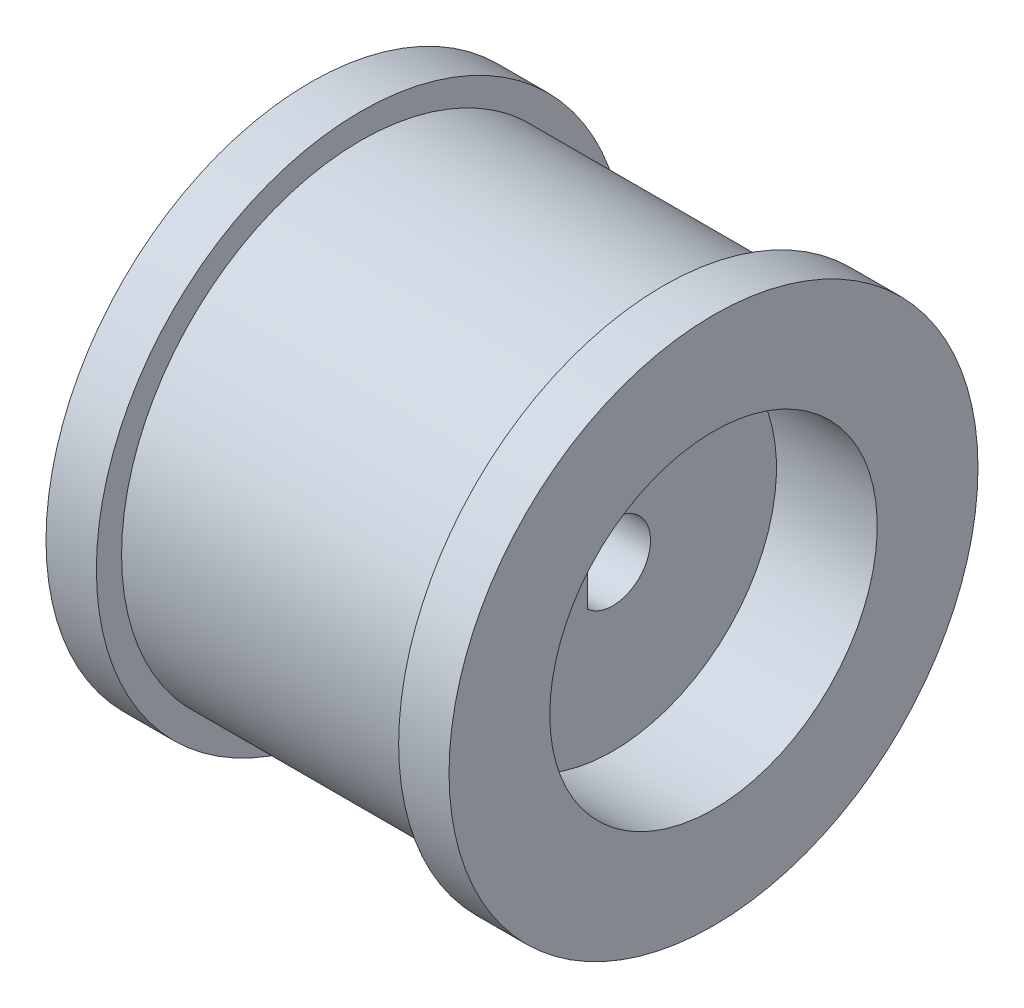
ISO-10303-21;
HEADER;
FILE_DESCRIPTION(('STEP AP214'),'2;1');
FILE_NAME('part.step','',(''),(''),'','','');
FILE_SCHEMA(('AUTOMOTIVE_DESIGN { 1 0 10303 214 1 1 1 1 }'));
ENDSEC;
DATA;
#1=APPLICATION_CONTEXT('core data for automotive mechanical design processes');
#2=APPLICATION_PROTOCOL_DEFINITION('international standard','automotive_design',2000,#1);
#3=PRODUCT_CONTEXT('',#1,'mechanical');
#4=PRODUCT('Part','Part','',(#3));
#5=PRODUCT_RELATED_PRODUCT_CATEGORY('part','',(#4));
#6=PRODUCT_DEFINITION_FORMATION('','',#4);
#7=PRODUCT_DEFINITION_CONTEXT('part definition',#1,'design');
#8=PRODUCT_DEFINITION('design','',#6,#7);
#9=PRODUCT_DEFINITION_SHAPE('','',#8);
#10=(LENGTH_UNIT() NAMED_UNIT(*) SI_UNIT(.MILLI.,.METRE.));
#11=(NAMED_UNIT(*) PLANE_ANGLE_UNIT() SI_UNIT($,.RADIAN.));
#12=(NAMED_UNIT(*) SI_UNIT($,.STERADIAN.) SOLID_ANGLE_UNIT());
#13=UNCERTAINTY_MEASURE_WITH_UNIT(LENGTH_MEASURE(1.E-05),#10,'distance_accuracy_value','');
#14=(GEOMETRIC_REPRESENTATION_CONTEXT(3) GLOBAL_UNCERTAINTY_ASSIGNED_CONTEXT((#13)) GLOBAL_UNIT_ASSIGNED_CONTEXT((#10,
#11,#12)) REPRESENTATION_CONTEXT('',''));
#15=CARTESIAN_POINT('',(0.,0.,0.));
#16=DIRECTION('',(0.,0.,1.));
#17=DIRECTION('',(1.,0.,0.));
#18=AXIS2_PLACEMENT_3D('',#15,#16,#17);
#19=CARTESIAN_POINT('',(-5.99999999999998,9.5,0.));
#20=DIRECTION('',(-1.,0.,0.));
#21=DIRECTION('',(0.,0.,1.));
#22=AXIS2_PLACEMENT_3D('',#19,#20,#21);
#23=PLANE('',#22);
#24=CARTESIAN_POINT('',(-5.99999999999998,0.,0.));
#25=DIRECTION('',(-1.,0.,0.));
#26=DIRECTION('',(0.,0.,1.));
#27=AXIS2_PLACEMENT_3D('',#24,#25,#26);
#28=CIRCLE('',#27,10.5);
#29=CARTESIAN_POINT('',(-5.99999999999998,0.,10.5));
#30=VERTEX_POINT('',#29);
#31=EDGE_CURVE('E11',#30,#30,#28,.T.);
#32=ORIENTED_EDGE('',*,*,#31,.F.);
#33=EDGE_LOOP('',(#32));
#34=FACE_BOUND('',#33,.T.);
#35=CARTESIAN_POINT('',(-5.99999999999998,0.,0.));
#36=DIRECTION('',(-1.,0.,0.));
#37=DIRECTION('',(0.,0.,1.));
#38=AXIS2_PLACEMENT_3D('',#35,#36,#37);
#39=CIRCLE('',#38,9.5);
#40=CARTESIAN_POINT('',(-5.99999999999998,0.,9.5));
#41=VERTEX_POINT('',#40);
#42=EDGE_CURVE('E77',#41,#41,#39,.T.);
#43=ORIENTED_EDGE('',*,*,#42,.T.);
#44=EDGE_LOOP('',(#43));
#45=FACE_BOUND('',#44,.T.);
#46=ADVANCED_FACE('F32',(#34,#45),#23,.F.);
#47=CARTESIAN_POINT('',(-167.001765704584,0.,0.));
#48=DIRECTION('',(-1.,0.,0.));
#49=DIRECTION('',(0.,0.,1.));
#50=AXIS2_PLACEMENT_3D('',#47,#48,#49);
#51=CYLINDRICAL_SURFACE('',#50,10.5);
#52=CARTESIAN_POINT('',(-7.99999999999998,0.,0.));
#53=DIRECTION('',(-1.,0.,0.));
#54=DIRECTION('',(0.,0.,1.));
#55=AXIS2_PLACEMENT_3D('',#52,#53,#54);
#56=CIRCLE('',#55,10.5);
#57=CARTESIAN_POINT('',(-7.99999999999998,0.,10.5));
#58=VERTEX_POINT('',#57);
#59=EDGE_CURVE('E39',#58,#58,#56,.T.);
#60=ORIENTED_EDGE('',*,*,#59,.F.);
#61=EDGE_LOOP('',(#60));
#62=FACE_BOUND('',#61,.T.);
#63=ORIENTED_EDGE('',*,*,#31,.T.);
#64=EDGE_LOOP('',(#63));
#65=FACE_BOUND('',#64,.T.);
#66=ADVANCED_FACE('F105',(#62,#65),#51,.T.);
#67=CARTESIAN_POINT('',(-7.99999999999998,10.5,0.));
#68=DIRECTION('',(1.,0.,0.));
#69=DIRECTION('',(0.,0.,-1.));
#70=AXIS2_PLACEMENT_3D('',#67,#68,#69);
#71=PLANE('',#70);
#72=CARTESIAN_POINT('',(-7.99999999999998,0.,0.));
#73=DIRECTION('',(-1.,0.,0.));
#74=DIRECTION('',(0.,0.,1.));
#75=AXIS2_PLACEMENT_3D('',#72,#73,#74);
#76=CIRCLE('',#75,6.5);
#77=CARTESIAN_POINT('',(-7.99999999999998,0.,6.5));
#78=VERTEX_POINT('',#77);
#79=EDGE_CURVE('E98',#78,#78,#76,.T.);
#80=ORIENTED_EDGE('',*,*,#79,.F.);
#81=EDGE_LOOP('',(#80));
#82=FACE_BOUND('',#81,.T.);
#83=ORIENTED_EDGE('',*,*,#59,.T.);
#84=EDGE_LOOP('',(#83));
#85=FACE_BOUND('',#84,.T.);
#86=ADVANCED_FACE('F103',(#82,#85),#71,.F.);
#87=CARTESIAN_POINT('',(-167.001765704584,0.,0.));
#88=DIRECTION('',(-1.,0.,0.));
#89=DIRECTION('',(0.,0.,1.));
#90=AXIS2_PLACEMENT_3D('',#87,#88,#89);
#91=CYLINDRICAL_SURFACE('',#90,6.5);
#92=CARTESIAN_POINT('',(-3.99999999999998,0.,0.));
#93=DIRECTION('',(-1.,0.,0.));
#94=DIRECTION('',(0.,0.,1.));
#95=AXIS2_PLACEMENT_3D('',#92,#93,#94);
#96=CIRCLE('',#95,6.5);
#97=CARTESIAN_POINT('',(-3.99999999999998,0.,6.5));
#98=VERTEX_POINT('',#97);
#99=EDGE_CURVE('E95',#98,#98,#96,.T.);
#100=ORIENTED_EDGE('',*,*,#99,.F.);
#101=EDGE_LOOP('',(#100));
#102=FACE_BOUND('',#101,.T.);
#103=ORIENTED_EDGE('',*,*,#79,.T.);
#104=EDGE_LOOP('',(#103));
#105=FACE_BOUND('',#104,.T.);
#106=ADVANCED_FACE('F149',(#102,#105),#91,.F.);
#107=CARTESIAN_POINT('',(-3.99999999999998,6.5,0.));
#108=DIRECTION('',(1.,0.,0.));
#109=DIRECTION('',(0.,0.,-1.));
#110=AXIS2_PLACEMENT_3D('',#107,#108,#109);
#111=PLANE('',#110);
#112=DIRECTION('',(0.,-1.,0.));
#113=VECTOR('',#112,1.);
#114=CARTESIAN_POINT('',(-3.99999999999998,6.5,1.));
#115=LINE('',#114,#113);
#116=CARTESIAN_POINT('',(-3.99999999999998,1.1180339887499,1.));
#117=VERTEX_POINT('',#116);
#118=CARTESIAN_POINT('',(-3.99999999999998,-1.1180339887499,1.));
#119=VERTEX_POINT('',#118);
#120=EDGE_CURVE('E62',#117,#119,#115,.T.);
#121=ORIENTED_EDGE('',*,*,#120,.T.);
#122=CARTESIAN_POINT('',(-3.99999999999998,0.,0.));
#123=DIRECTION('',(1.,0.,0.));
#124=DIRECTION('',(0.,0.,-1.));
#125=AXIS2_PLACEMENT_3D('',#122,#123,#124);
#126=CIRCLE('',#125,1.5);
#127=EDGE_CURVE('E60',#119,#117,#126,.T.);
#128=ORIENTED_EDGE('',*,*,#127,.T.);
#129=EDGE_LOOP('',(#121,#128));
#130=FACE_BOUND('',#129,.T.);
#131=ORIENTED_EDGE('',*,*,#99,.T.);
#132=EDGE_LOOP('',(#131));
#133=FACE_BOUND('',#132,.T.);
#134=ADVANCED_FACE('F144',(#130,#133),#111,.F.);
#135=CARTESIAN_POINT('',(4.,6.5,0.));
#136=DIRECTION('',(-1.,0.,0.));
#137=DIRECTION('',(0.,0.,1.));
#138=AXIS2_PLACEMENT_3D('',#135,#136,#137);
#139=PLANE('',#138);
#140=DIRECTION('',(0.,-1.,0.));
#141=VECTOR('',#140,1.);
#142=CARTESIAN_POINT('',(4.,1.1180339887499,1.));
#143=LINE('',#142,#141);
#144=CARTESIAN_POINT('',(4.,1.1180339887499,1.));
#145=VERTEX_POINT('',#144);
#146=CARTESIAN_POINT('',(4.,-1.1180339887499,1.));
#147=VERTEX_POINT('',#146);
#148=EDGE_CURVE('E66',#145,#147,#143,.T.);
#149=ORIENTED_EDGE('',*,*,#148,.F.);
#150=CARTESIAN_POINT('',(4.,0.,0.));
#151=DIRECTION('',(1.,0.,0.));
#152=DIRECTION('',(0.,0.,-1.));
#153=AXIS2_PLACEMENT_3D('',#150,#151,#152);
#154=CIRCLE('',#153,1.5);
#155=EDGE_CURVE('E53',#147,#145,#154,.T.);
#156=ORIENTED_EDGE('',*,*,#155,.F.);
#157=EDGE_LOOP('',(#149,#156));
#158=FACE_BOUND('',#157,.T.);
#159=CARTESIAN_POINT('',(4.,0.,0.));
#160=DIRECTION('',(-1.,0.,0.));
#161=DIRECTION('',(0.,0.,1.));
#162=AXIS2_PLACEMENT_3D('',#159,#160,#161);
#163=CIRCLE('',#162,6.5);
#164=CARTESIAN_POINT('',(4.,0.,6.5));
#165=VERTEX_POINT('',#164);
#166=EDGE_CURVE('E92',#165,#165,#163,.T.);
#167=ORIENTED_EDGE('',*,*,#166,.F.);
#168=EDGE_LOOP('',(#167));
#169=FACE_BOUND('',#168,.T.);
#170=ADVANCED_FACE('F70',(#158,#169),#139,.F.);
#171=CARTESIAN_POINT('',(-167.001765704584,0.,0.));
#172=DIRECTION('',(-1.,0.,0.));
#173=DIRECTION('',(0.,0.,1.));
#174=AXIS2_PLACEMENT_3D('',#171,#172,#173);
#175=CYLINDRICAL_SURFACE('',#174,6.5);
#176=CARTESIAN_POINT('',(8.00000000000001,0.,0.));
#177=DIRECTION('',(-1.,0.,0.));
#178=DIRECTION('',(0.,0.,1.));
#179=AXIS2_PLACEMENT_3D('',#176,#177,#178);
#180=CIRCLE('',#179,6.5);
#181=CARTESIAN_POINT('',(8.00000000000001,0.,6.5));
#182=VERTEX_POINT('',#181);
#183=EDGE_CURVE('E89',#182,#182,#180,.T.);
#184=ORIENTED_EDGE('',*,*,#183,.F.);
#185=EDGE_LOOP('',(#184));
#186=FACE_BOUND('',#185,.T.);
#187=ORIENTED_EDGE('',*,*,#166,.T.);
#188=EDGE_LOOP('',(#187));
#189=FACE_BOUND('',#188,.T.);
#190=ADVANCED_FACE('F135',(#186,#189),#175,.F.);
#191=CARTESIAN_POINT('',(8.00000000000002,10.5,0.));
#192=DIRECTION('',(-1.,0.,0.));
#193=DIRECTION('',(0.,0.,1.));
#194=AXIS2_PLACEMENT_3D('',#191,#192,#193);
#195=PLANE('',#194);
#196=CARTESIAN_POINT('',(8.00000000000001,0.,0.));
#197=DIRECTION('',(-1.,0.,0.));
#198=DIRECTION('',(0.,0.,1.));
#199=AXIS2_PLACEMENT_3D('',#196,#197,#198);
#200=CIRCLE('',#199,10.5);
#201=CARTESIAN_POINT('',(8.00000000000001,0.,10.5));
#202=VERTEX_POINT('',#201);
#203=EDGE_CURVE('E86',#202,#202,#200,.T.);
#204=ORIENTED_EDGE('',*,*,#203,.F.);
#205=EDGE_LOOP('',(#204));
#206=FACE_BOUND('',#205,.T.);
#207=ORIENTED_EDGE('',*,*,#183,.T.);
#208=EDGE_LOOP('',(#207));
#209=FACE_BOUND('',#208,.T.);
#210=ADVANCED_FACE('F129',(#206,#209),#195,.F.);
#211=CARTESIAN_POINT('',(-167.001765704584,0.,0.));
#212=DIRECTION('',(-1.,0.,0.));
#213=DIRECTION('',(0.,0.,1.));
#214=AXIS2_PLACEMENT_3D('',#211,#212,#213);
#215=CYLINDRICAL_SURFACE('',#214,10.5);
#216=CARTESIAN_POINT('',(6.00000000000001,0.,0.));
#217=DIRECTION('',(-1.,0.,0.));
#218=DIRECTION('',(0.,0.,1.));
#219=AXIS2_PLACEMENT_3D('',#216,#217,#218);
#220=CIRCLE('',#219,10.5);
#221=CARTESIAN_POINT('',(6.00000000000001,0.,10.5));
#222=VERTEX_POINT('',#221);
#223=EDGE_CURVE('E83',#222,#222,#220,.T.);
#224=ORIENTED_EDGE('',*,*,#223,.F.);
#225=EDGE_LOOP('',(#224));
#226=FACE_BOUND('',#225,.T.);
#227=ORIENTED_EDGE('',*,*,#203,.T.);
#228=EDGE_LOOP('',(#227));
#229=FACE_BOUND('',#228,.T.);
#230=ADVANCED_FACE('F123',(#226,#229),#215,.T.);
#231=CARTESIAN_POINT('',(6.00000000000002,9.5,0.));
#232=DIRECTION('',(1.,0.,0.));
#233=DIRECTION('',(0.,0.,-1.));
#234=AXIS2_PLACEMENT_3D('',#231,#232,#233);
#235=PLANE('',#234);
#236=CARTESIAN_POINT('',(6.00000000000001,0.,0.));
#237=DIRECTION('',(-1.,0.,0.));
#238=DIRECTION('',(0.,0.,1.));
#239=AXIS2_PLACEMENT_3D('',#236,#237,#238);
#240=CIRCLE('',#239,9.5);
#241=CARTESIAN_POINT('',(6.00000000000001,0.,9.5));
#242=VERTEX_POINT('',#241);
#243=EDGE_CURVE('E80',#242,#242,#240,.T.);
#244=ORIENTED_EDGE('',*,*,#243,.F.);
#245=EDGE_LOOP('',(#244));
#246=FACE_BOUND('',#245,.T.);
#247=ORIENTED_EDGE('',*,*,#223,.T.);
#248=EDGE_LOOP('',(#247));
#249=FACE_BOUND('',#248,.T.);
#250=ADVANCED_FACE('F117',(#246,#249),#235,.F.);
#251=CARTESIAN_POINT('',(-167.001765704584,0.,0.));
#252=DIRECTION('',(-1.,0.,0.));
#253=DIRECTION('',(0.,0.,1.));
#254=AXIS2_PLACEMENT_3D('',#251,#252,#253);
#255=CYLINDRICAL_SURFACE('',#254,9.5);
#256=ORIENTED_EDGE('',*,*,#42,.F.);
#257=EDGE_LOOP('',(#256));
#258=FACE_BOUND('',#257,.T.);
#259=ORIENTED_EDGE('',*,*,#243,.T.);
#260=EDGE_LOOP('',(#259));
#261=FACE_BOUND('',#260,.T.);
#262=ADVANCED_FACE('F114',(#258,#261),#255,.T.);
#263=CARTESIAN_POINT('',(-6.,0.,0.));
#264=DIRECTION('',(1.,0.,0.));
#265=DIRECTION('',(0.,0.,-1.));
#266=AXIS2_PLACEMENT_3D('',#263,#264,#265);
#267=CYLINDRICAL_SURFACE('',#266,1.5);
#268=DIRECTION('',(1.,0.,0.));
#269=VECTOR('',#268,1.);
#270=CARTESIAN_POINT('',(-6.,-1.1180339887499,1.));
#271=LINE('',#270,#269);
#272=EDGE_CURVE('E46',#119,#147,#271,.T.);
#273=ORIENTED_EDGE('',*,*,#272,.T.);
#274=ORIENTED_EDGE('',*,*,#155,.T.);
#275=DIRECTION('',(1.,0.,0.));
#276=VECTOR('',#275,1.);
#277=CARTESIAN_POINT('',(-6.,1.1180339887499,1.));
#278=LINE('',#277,#276);
#279=EDGE_CURVE('E63',#117,#145,#278,.T.);
#280=ORIENTED_EDGE('',*,*,#279,.F.);
#281=ORIENTED_EDGE('',*,*,#127,.F.);
#282=EDGE_LOOP('',(#273,#274,#280,#281));
#283=FACE_BOUND('',#282,.T.);
#284=ADVANCED_FACE('F58',(#283),#267,.F.);
#285=CARTESIAN_POINT('',(-6.,1.1180339887499,1.));
#286=DIRECTION('',(0.,0.,1.));
#287=DIRECTION('',(1.,0.,0.));
#288=AXIS2_PLACEMENT_3D('',#285,#286,#287);
#289=PLANE('',#288);
#290=ORIENTED_EDGE('',*,*,#279,.T.);
#291=ORIENTED_EDGE('',*,*,#148,.T.);
#292=ORIENTED_EDGE('',*,*,#272,.F.);
#293=ORIENTED_EDGE('',*,*,#120,.F.);
#294=EDGE_LOOP('',(#290,#291,#292,#293));
#295=FACE_BOUND('',#294,.T.);
#296=ADVANCED_FACE('F67',(#295),#289,.F.);
#297=CLOSED_SHELL('',(#46,#66,#86,#106,#134,#170,#190,#210,#230,#250,#262,#284,#296));
#298=MANIFOLD_SOLID_BREP('B2',#297);
#299=ADVANCED_BREP_SHAPE_REPRESENTATION('',(#18,#298),#14);
#300=SHAPE_DEFINITION_REPRESENTATION(#9,#299);
ENDSEC;
END-ISO-10303-21;
